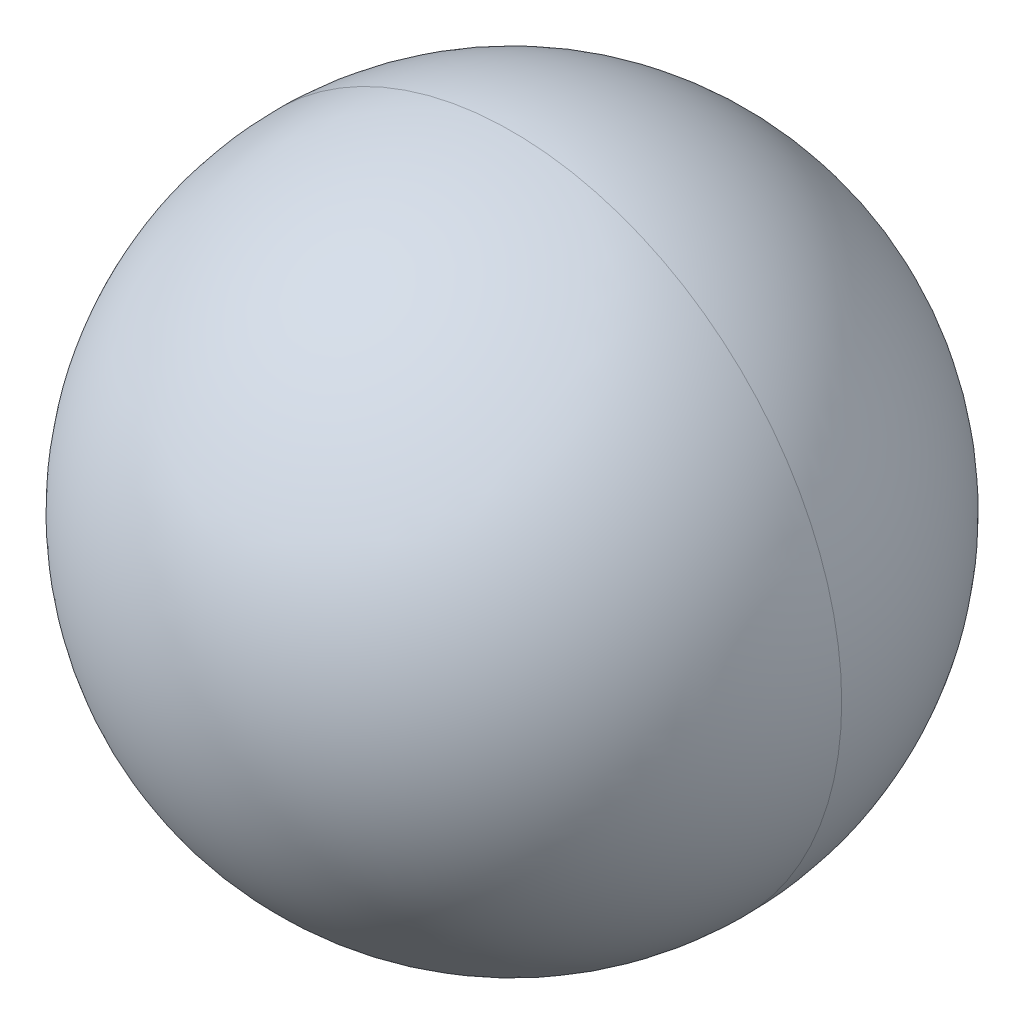
ISO-10303-21;
HEADER;
FILE_DESCRIPTION(('STEP AP214'),'2;1');
FILE_NAME('part.step','',(''),(''),'','','');
FILE_SCHEMA(('AUTOMOTIVE_DESIGN { 1 0 10303 214 1 1 1 1 }'));
ENDSEC;
DATA;
#1=APPLICATION_CONTEXT('core data for automotive mechanical design processes');
#2=APPLICATION_PROTOCOL_DEFINITION('international standard','automotive_design',2000,#1);
#3=PRODUCT_CONTEXT('',#1,'mechanical');
#4=PRODUCT('Part','Part','',(#3));
#5=PRODUCT_RELATED_PRODUCT_CATEGORY('part','',(#4));
#6=PRODUCT_DEFINITION_FORMATION('','',#4);
#7=PRODUCT_DEFINITION_CONTEXT('part definition',#1,'design');
#8=PRODUCT_DEFINITION('design','',#6,#7);
#9=PRODUCT_DEFINITION_SHAPE('','',#8);
#10=(LENGTH_UNIT() NAMED_UNIT(*) SI_UNIT(.MILLI.,.METRE.));
#11=(NAMED_UNIT(*) PLANE_ANGLE_UNIT() SI_UNIT($,.RADIAN.));
#12=(NAMED_UNIT(*) SI_UNIT($,.STERADIAN.) SOLID_ANGLE_UNIT());
#13=UNCERTAINTY_MEASURE_WITH_UNIT(LENGTH_MEASURE(1.E-05),#10,'distance_accuracy_value','');
#14=(GEOMETRIC_REPRESENTATION_CONTEXT(3) GLOBAL_UNCERTAINTY_ASSIGNED_CONTEXT((#13)) GLOBAL_UNIT_ASSIGNED_CONTEXT((#10,
#11,#12)) REPRESENTATION_CONTEXT('',''));
#15=CARTESIAN_POINT('',(0.,0.,0.));
#16=DIRECTION('',(0.,0.,1.));
#17=DIRECTION('',(1.,0.,0.));
#18=AXIS2_PLACEMENT_3D('',#15,#16,#17);
#19=CARTESIAN_POINT('',(4.5,11.75,0.));
#20=DIRECTION('',(1.,0.,0.));
#21=DIRECTION('',(0.,0.,-1.));
#22=AXIS2_PLACEMENT_3D('',#19,#20,#21);
#23=SPHERICAL_SURFACE('',#22,2.381);
#24=CARTESIAN_POINT('',(4.5,11.75,0.));
#25=DIRECTION('',(0.,0.,1.));
#26=DIRECTION('',(1.,0.,0.));
#27=AXIS2_PLACEMENT_3D('',#24,#25,#26);
#28=CIRCLE('',#27,2.381);
#29=CARTESIAN_POINT('',(6.881,11.75,0.));
#30=VERTEX_POINT('',#29);
#31=CARTESIAN_POINT('',(2.119,11.75,0.));
#32=VERTEX_POINT('',#31);
#33=EDGE_CURVE('E11',#30,#32,#28,.T.);
#34=ORIENTED_EDGE('',*,*,#33,.T.);
#35=CARTESIAN_POINT('',(4.5,11.75,0.));
#36=DIRECTION('',(0.,0.,-1.));
#37=DIRECTION('',(1.,0.,0.));
#38=AXIS2_PLACEMENT_3D('',#35,#36,#37);
#39=CIRCLE('',#38,2.381);
#40=EDGE_CURVE('E25',#30,#32,#39,.T.);
#41=ORIENTED_EDGE('',*,*,#40,.F.);
#42=EDGE_LOOP('',(#34,#41));
#43=FACE_BOUND('',#42,.T.);
#44=ADVANCED_FACE('F17',(#43),#23,.T.);
#45=CARTESIAN_POINT('',(4.5,11.75,0.));
#46=DIRECTION('',(1.,0.,0.));
#47=DIRECTION('',(0.,0.,1.));
#48=AXIS2_PLACEMENT_3D('',#45,#46,#47);
#49=SPHERICAL_SURFACE('',#48,2.381);
#50=ORIENTED_EDGE('',*,*,#33,.F.);
#51=ORIENTED_EDGE('',*,*,#40,.T.);
#52=EDGE_LOOP('',(#50,#51));
#53=FACE_BOUND('',#52,.T.);
#54=ADVANCED_FACE('F33',(#53),#49,.T.);
#55=CLOSED_SHELL('',(#44,#54));
#56=MANIFOLD_SOLID_BREP('B1',#55);
#57=ADVANCED_BREP_SHAPE_REPRESENTATION('',(#18,#56),#14);
#58=SHAPE_DEFINITION_REPRESENTATION(#9,#57);
ENDSEC;
END-ISO-10303-21;
